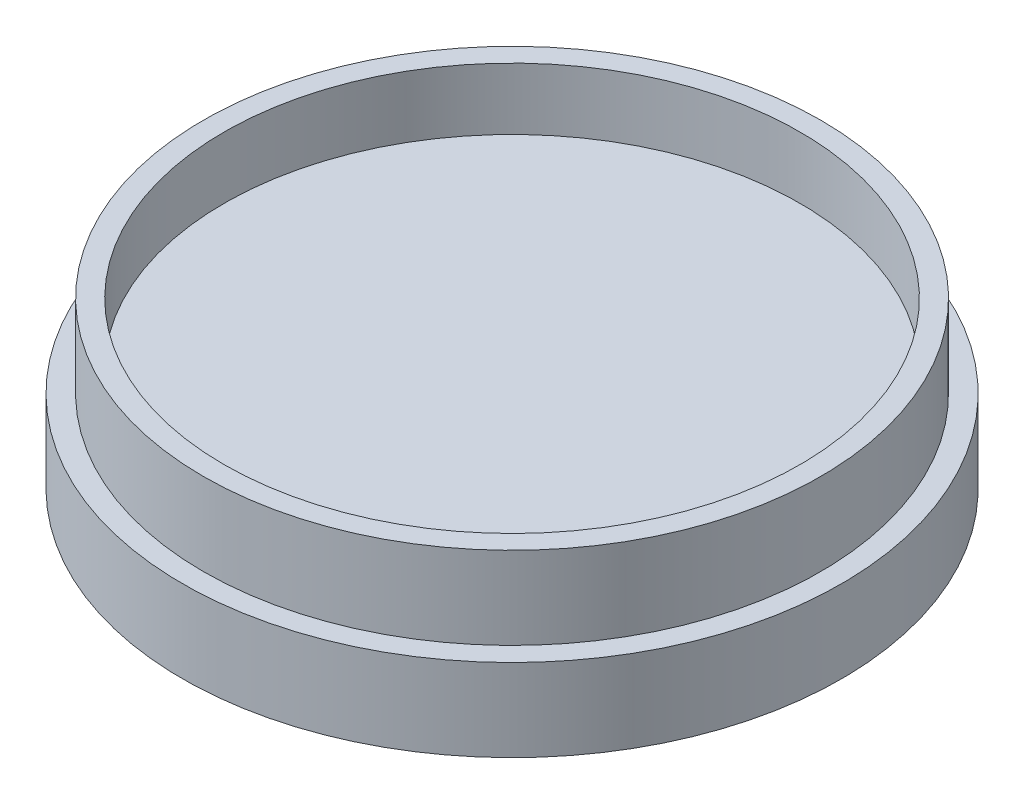
ISO-10303-21;
HEADER;
FILE_DESCRIPTION(('STEP AP214'),'2;1');
FILE_NAME('part.step','',(''),(''),'','','');
FILE_SCHEMA(('AUTOMOTIVE_DESIGN { 1 0 10303 214 1 1 1 1 }'));
ENDSEC;
DATA;
#1=APPLICATION_CONTEXT('core data for automotive mechanical design processes');
#2=APPLICATION_PROTOCOL_DEFINITION('international standard','automotive_design',2000,#1);
#3=PRODUCT_CONTEXT('',#1,'mechanical');
#4=PRODUCT('Part','Part','',(#3));
#5=PRODUCT_RELATED_PRODUCT_CATEGORY('part','',(#4));
#6=PRODUCT_DEFINITION_FORMATION('','',#4);
#7=PRODUCT_DEFINITION_CONTEXT('part definition',#1,'design');
#8=PRODUCT_DEFINITION('design','',#6,#7);
#9=PRODUCT_DEFINITION_SHAPE('','',#8);
#10=(LENGTH_UNIT() NAMED_UNIT(*) SI_UNIT(.MILLI.,.METRE.));
#11=(NAMED_UNIT(*) PLANE_ANGLE_UNIT() SI_UNIT($,.RADIAN.));
#12=(NAMED_UNIT(*) SI_UNIT($,.STERADIAN.) SOLID_ANGLE_UNIT());
#13=UNCERTAINTY_MEASURE_WITH_UNIT(LENGTH_MEASURE(1.E-05),#10,'distance_accuracy_value','');
#14=(GEOMETRIC_REPRESENTATION_CONTEXT(3) GLOBAL_UNCERTAINTY_ASSIGNED_CONTEXT((#13)) GLOBAL_UNIT_ASSIGNED_CONTEXT((#10,
#11,#12)) REPRESENTATION_CONTEXT('',''));
#15=CARTESIAN_POINT('',(0.,0.,0.));
#16=DIRECTION('',(0.,0.,1.));
#17=DIRECTION('',(1.,0.,0.));
#18=AXIS2_PLACEMENT_3D('',#15,#16,#17);
#19=CARTESIAN_POINT('',(0.,25.4,0.));
#20=DIRECTION('',(0.,-1.,0.));
#21=DIRECTION('',(0.,0.,-1.));
#22=AXIS2_PLACEMENT_3D('',#19,#20,#21);
#23=CYLINDRICAL_SURFACE('',#22,95.149999946);
#24=CARTESIAN_POINT('',(0.,25.4,0.));
#25=DIRECTION('',(0.,1.,0.));
#26=DIRECTION('',(0.,0.,1.));
#27=AXIS2_PLACEMENT_3D('',#24,#25,#26);
#28=CIRCLE('',#27,95.149999946);
#29=CARTESIAN_POINT('',(0.,25.4,95.149999946));
#30=VERTEX_POINT('',#29);
#31=EDGE_CURVE('E10',#30,#30,#28,.T.);
#32=ORIENTED_EDGE('',*,*,#31,.F.);
#33=EDGE_LOOP('',(#32));
#34=FACE_BOUND('',#33,.T.);
#35=CARTESIAN_POINT('',(0.,0.,0.));
#36=DIRECTION('',(0.,1.,0.));
#37=DIRECTION('',(0.,0.,1.));
#38=AXIS2_PLACEMENT_3D('',#35,#36,#37);
#39=CIRCLE('',#38,95.149999946);
#40=CARTESIAN_POINT('',(0.,0.,95.149999946));
#41=VERTEX_POINT('',#40);
#42=EDGE_CURVE('E34',#41,#41,#39,.T.);
#43=ORIENTED_EDGE('',*,*,#42,.T.);
#44=EDGE_LOOP('',(#43));
#45=FACE_BOUND('',#44,.T.);
#46=ADVANCED_FACE('F31',(#34,#45),#23,.T.);
#47=CARTESIAN_POINT('',(0.,25.4,0.));
#48=DIRECTION('',(0.,1.,0.));
#49=DIRECTION('',(0.,0.,1.));
#50=AXIS2_PLACEMENT_3D('',#47,#48,#49);
#51=PLANE('',#50);
#52=CARTESIAN_POINT('',(0.,25.4,0.));
#53=DIRECTION('',(0.,1.,0.));
#54=DIRECTION('',(0.,0.,1.));
#55=AXIS2_PLACEMENT_3D('',#52,#53,#54);
#56=CIRCLE('',#55,88.8);
#57=CARTESIAN_POINT('',(0.,25.4,88.8));
#58=VERTEX_POINT('',#57);
#59=EDGE_CURVE('E42',#58,#58,#56,.T.);
#60=ORIENTED_EDGE('',*,*,#59,.F.);
#61=EDGE_LOOP('',(#60));
#62=FACE_BOUND('',#61,.T.);
#63=ORIENTED_EDGE('',*,*,#31,.T.);
#64=EDGE_LOOP('',(#63));
#65=FACE_BOUND('',#64,.T.);
#66=ADVANCED_FACE('F127',(#62,#65),#51,.T.);
#67=CARTESIAN_POINT('',(0.,6.35,0.));
#68=DIRECTION('',(0.,1.,0.));
#69=DIRECTION('',(0.,0.,1.));
#70=AXIS2_PLACEMENT_3D('',#67,#68,#69);
#71=CYLINDRICAL_SURFACE('',#70,88.8);
#72=CARTESIAN_POINT('',(0.,6.35,0.));
#73=DIRECTION('',(0.,1.,0.));
#74=DIRECTION('',(0.,0.,1.));
#75=AXIS2_PLACEMENT_3D('',#72,#73,#74);
#76=CIRCLE('',#75,88.8);
#77=CARTESIAN_POINT('',(0.,6.35,88.8));
#78=VERTEX_POINT('',#77);
#79=EDGE_CURVE('E38',#78,#78,#76,.T.);
#80=ORIENTED_EDGE('',*,*,#79,.F.);
#81=EDGE_LOOP('',(#80));
#82=FACE_BOUND('',#81,.T.);
#83=ORIENTED_EDGE('',*,*,#59,.T.);
#84=EDGE_LOOP('',(#83));
#85=FACE_BOUND('',#84,.T.);
#86=ADVANCED_FACE('F132',(#82,#85),#71,.F.);
#87=CARTESIAN_POINT('',(0.,6.35,0.));
#88=DIRECTION('',(0.,1.,0.));
#89=DIRECTION('',(0.,0.,1.));
#90=AXIS2_PLACEMENT_3D('',#87,#88,#89);
#91=PLANE('',#90);
#92=ORIENTED_EDGE('',*,*,#79,.T.);
#93=EDGE_LOOP('',(#92));
#94=FACE_BOUND('',#93,.T.);
#95=ADVANCED_FACE('F111',(#94),#91,.T.);
#96=CARTESIAN_POINT('',(0.,-25.4,0.));
#97=DIRECTION('',(0.,1.,0.));
#98=DIRECTION('',(0.,0.,1.));
#99=AXIS2_PLACEMENT_3D('',#96,#97,#98);
#100=CYLINDRICAL_SURFACE('',#99,101.6);
#101=CARTESIAN_POINT('',(0.,-25.4,0.));
#102=DIRECTION('',(0.,-1.,0.));
#103=DIRECTION('',(0.,0.,-1.));
#104=AXIS2_PLACEMENT_3D('',#101,#102,#103);
#105=CIRCLE('',#104,101.6);
#106=CARTESIAN_POINT('',(0.,-25.4,-101.6));
#107=VERTEX_POINT('',#106);
#108=EDGE_CURVE('E50',#107,#107,#105,.T.);
#109=ORIENTED_EDGE('',*,*,#108,.F.);
#110=EDGE_LOOP('',(#109));
#111=FACE_BOUND('',#110,.T.);
#112=CARTESIAN_POINT('',(0.,0.,0.));
#113=DIRECTION('',(0.,-1.,0.));
#114=DIRECTION('',(0.,0.,-1.));
#115=AXIS2_PLACEMENT_3D('',#112,#113,#114);
#116=CIRCLE('',#115,101.6);
#117=CARTESIAN_POINT('',(0.,0.,-101.6));
#118=VERTEX_POINT('',#117);
#119=EDGE_CURVE('E47',#118,#118,#116,.T.);
#120=ORIENTED_EDGE('',*,*,#119,.T.);
#121=EDGE_LOOP('',(#120));
#122=FACE_BOUND('',#121,.T.);
#123=ADVANCED_FACE('F97',(#111,#122),#100,.T.);
#124=CARTESIAN_POINT('',(0.,-25.4,0.));
#125=DIRECTION('',(0.,-1.,0.));
#126=DIRECTION('',(0.,0.,-1.));
#127=AXIS2_PLACEMENT_3D('',#124,#125,#126);
#128=PLANE('',#127);
#129=CARTESIAN_POINT('',(0.,-25.4,82.55));
#130=DIRECTION('',(0.,-1.,0.));
#131=DIRECTION('',(0.,0.,-1.));
#132=AXIS2_PLACEMENT_3D('',#129,#130,#131);
#133=CIRCLE('',#132,12.827);
#134=CARTESIAN_POINT('',(0.,-25.4,69.723));
#135=VERTEX_POINT('',#134);
#136=EDGE_CURVE('E78',#135,#135,#133,.T.);
#137=ORIENTED_EDGE('',*,*,#136,.F.);
#138=EDGE_LOOP('',(#137));
#139=FACE_BOUND('',#138,.T.);
#140=CARTESIAN_POINT('',(78.5097154201666,-25.4,25.5093528856541));
#141=DIRECTION('',(0.,-1.,0.));
#142=DIRECTION('',(0.,0.,-1.));
#143=AXIS2_PLACEMENT_3D('',#140,#141,#142);
#144=CIRCLE('',#143,12.827);
#145=CARTESIAN_POINT('',(78.5097154201666,-25.4,12.6823528856541));
#146=VERTEX_POINT('',#145);
#147=EDGE_CURVE('E72',#146,#146,#144,.T.);
#148=ORIENTED_EDGE('',*,*,#147,.F.);
#149=EDGE_LOOP('',(#148));
#150=FACE_BOUND('',#149,.T.);
#151=CARTESIAN_POINT('',(48.5216725767479,-25.4,-66.7843528856505));
#152=DIRECTION('',(0.,-1.,0.));
#153=DIRECTION('',(0.,0.,-1.));
#154=AXIS2_PLACEMENT_3D('',#151,#152,#153);
#155=CIRCLE('',#154,12.827);
#156=CARTESIAN_POINT('',(48.5216725767479,-25.4,-79.6113528856505));
#157=VERTEX_POINT('',#156);
#158=EDGE_CURVE('E66',#157,#157,#155,.T.);
#159=ORIENTED_EDGE('',*,*,#158,.F.);
#160=EDGE_LOOP('',(#159));
#161=FACE_BOUND('',#160,.T.);
#162=CARTESIAN_POINT('',(-48.5216725767394,-25.4,-66.7843528856533));
#163=DIRECTION('',(0.,-1.,0.));
#164=DIRECTION('',(0.,0.,-1.));
#165=AXIS2_PLACEMENT_3D('',#162,#163,#164);
#166=CIRCLE('',#165,12.827);
#167=CARTESIAN_POINT('',(-48.5216725767394,-25.4,-79.6113528856533));
#168=VERTEX_POINT('',#167);
#169=EDGE_CURVE('E60',#168,#168,#166,.T.);
#170=ORIENTED_EDGE('',*,*,#169,.F.);
#171=EDGE_LOOP('',(#170));
#172=FACE_BOUND('',#171,.T.);
#173=CARTESIAN_POINT('',(-78.5097154201633,-25.4,25.5093528856497));
#174=DIRECTION('',(0.,-1.,0.));
#175=DIRECTION('',(0.,0.,-1.));
#176=AXIS2_PLACEMENT_3D('',#173,#174,#175);
#177=CIRCLE('',#176,12.827);
#178=CARTESIAN_POINT('',(-78.5097154201633,-25.4,12.6823528856497));
#179=VERTEX_POINT('',#178);
#180=EDGE_CURVE('E54',#179,#179,#177,.T.);
#181=ORIENTED_EDGE('',*,*,#180,.F.);
#182=EDGE_LOOP('',(#181));
#183=FACE_BOUND('',#182,.T.);
#184=ORIENTED_EDGE('',*,*,#108,.T.);
#185=EDGE_LOOP('',(#184));
#186=FACE_BOUND('',#185,.T.);
#187=ADVANCED_FACE('F93',(#139,#150,#161,#172,#183,#186),#128,.T.);
#188=CARTESIAN_POINT('',(0.,0.,0.));
#189=DIRECTION('',(0.,-1.,0.));
#190=DIRECTION('',(0.,0.,-1.));
#191=AXIS2_PLACEMENT_3D('',#188,#189,#190);
#192=PLANE('',#191);
#193=ORIENTED_EDGE('',*,*,#42,.F.);
#194=EDGE_LOOP('',(#193));
#195=FACE_BOUND('',#194,.T.);
#196=ORIENTED_EDGE('',*,*,#119,.F.);
#197=EDGE_LOOP('',(#196));
#198=FACE_BOUND('',#197,.T.);
#199=ADVANCED_FACE('F96',(#195,#198),#192,.F.);
#200=CARTESIAN_POINT('',(-78.5097154201633,-6.35,25.5093528856497));
#201=DIRECTION('',(0.,-1.,0.));
#202=DIRECTION('',(0.,0.,-1.));
#203=AXIS2_PLACEMENT_3D('',#200,#201,#202);
#204=CYLINDRICAL_SURFACE('',#203,12.827);
#205=CARTESIAN_POINT('',(-78.5097154201633,-6.35,25.5093528856497));
#206=DIRECTION('',(0.,-1.,0.));
#207=DIRECTION('',(0.,0.,-1.));
#208=AXIS2_PLACEMENT_3D('',#205,#206,#207);
#209=CIRCLE('',#208,12.827);
#210=CARTESIAN_POINT('',(-78.5097154201633,-6.35,12.6823528856497));
#211=VERTEX_POINT('',#210);
#212=EDGE_CURVE('E57',#211,#211,#209,.T.);
#213=ORIENTED_EDGE('',*,*,#212,.F.);
#214=EDGE_LOOP('',(#213));
#215=FACE_BOUND('',#214,.T.);
#216=ORIENTED_EDGE('',*,*,#180,.T.);
#217=EDGE_LOOP('',(#216));
#218=FACE_BOUND('',#217,.T.);
#219=ADVANCED_FACE('F116',(#215,#218),#204,.F.);
#220=CARTESIAN_POINT('',(-78.5097154201633,-6.35,25.5093528856497));
#221=DIRECTION('',(0.,-1.,0.));
#222=DIRECTION('',(0.,0.,-1.));
#223=AXIS2_PLACEMENT_3D('',#220,#221,#222);
#224=PLANE('',#223);
#225=ORIENTED_EDGE('',*,*,#212,.T.);
#226=EDGE_LOOP('',(#225));
#227=FACE_BOUND('',#226,.T.);
#228=ADVANCED_FACE('F122',(#227),#224,.T.);
#229=CARTESIAN_POINT('',(-48.5216725767394,-6.35,-66.7843528856533));
#230=DIRECTION('',(0.,-1.,0.));
#231=DIRECTION('',(0.,0.,-1.));
#232=AXIS2_PLACEMENT_3D('',#229,#230,#231);
#233=CYLINDRICAL_SURFACE('',#232,12.827);
#234=CARTESIAN_POINT('',(-48.5216725767394,-6.35,-66.7843528856533));
#235=DIRECTION('',(0.,-1.,0.));
#236=DIRECTION('',(0.,0.,-1.));
#237=AXIS2_PLACEMENT_3D('',#234,#235,#236);
#238=CIRCLE('',#237,12.827);
#239=CARTESIAN_POINT('',(-48.5216725767394,-6.35,-79.6113528856533));
#240=VERTEX_POINT('',#239);
#241=EDGE_CURVE('E63',#240,#240,#238,.T.);
#242=ORIENTED_EDGE('',*,*,#241,.F.);
#243=EDGE_LOOP('',(#242));
#244=FACE_BOUND('',#243,.T.);
#245=ORIENTED_EDGE('',*,*,#169,.T.);
#246=EDGE_LOOP('',(#245));
#247=FACE_BOUND('',#246,.T.);
#248=ADVANCED_FACE('F176',(#244,#247),#233,.F.);
#249=CARTESIAN_POINT('',(-48.5216725767394,-6.35,-66.7843528856533));
#250=DIRECTION('',(0.,-1.,0.));
#251=DIRECTION('',(0.,0.,-1.));
#252=AXIS2_PLACEMENT_3D('',#249,#250,#251);
#253=PLANE('',#252);
#254=ORIENTED_EDGE('',*,*,#241,.T.);
#255=EDGE_LOOP('',(#254));
#256=FACE_BOUND('',#255,.T.);
#257=ADVANCED_FACE('F186',(#256),#253,.T.);
#258=CARTESIAN_POINT('',(48.5216725767479,-6.35,-66.7843528856505));
#259=DIRECTION('',(0.,-1.,0.));
#260=DIRECTION('',(0.,0.,-1.));
#261=AXIS2_PLACEMENT_3D('',#258,#259,#260);
#262=CYLINDRICAL_SURFACE('',#261,12.827);
#263=CARTESIAN_POINT('',(48.5216725767479,-6.35,-66.7843528856505));
#264=DIRECTION('',(0.,-1.,0.));
#265=DIRECTION('',(0.,0.,-1.));
#266=AXIS2_PLACEMENT_3D('',#263,#264,#265);
#267=CIRCLE('',#266,12.827);
#268=CARTESIAN_POINT('',(48.5216725767479,-6.35,-79.6113528856505));
#269=VERTEX_POINT('',#268);
#270=EDGE_CURVE('E69',#269,#269,#267,.T.);
#271=ORIENTED_EDGE('',*,*,#270,.F.);
#272=EDGE_LOOP('',(#271));
#273=FACE_BOUND('',#272,.T.);
#274=ORIENTED_EDGE('',*,*,#158,.T.);
#275=EDGE_LOOP('',(#274));
#276=FACE_BOUND('',#275,.T.);
#277=ADVANCED_FACE('F196',(#273,#276),#262,.F.);
#278=CARTESIAN_POINT('',(48.5216725767479,-6.35,-66.7843528856505));
#279=DIRECTION('',(0.,-1.,0.));
#280=DIRECTION('',(0.,0.,-1.));
#281=AXIS2_PLACEMENT_3D('',#278,#279,#280);
#282=PLANE('',#281);
#283=ORIENTED_EDGE('',*,*,#270,.T.);
#284=EDGE_LOOP('',(#283));
#285=FACE_BOUND('',#284,.T.);
#286=ADVANCED_FACE('F206',(#285),#282,.T.);
#287=CARTESIAN_POINT('',(78.5097154201666,-6.35,25.5093528856541));
#288=DIRECTION('',(0.,-1.,0.));
#289=DIRECTION('',(0.,0.,-1.));
#290=AXIS2_PLACEMENT_3D('',#287,#288,#289);
#291=CYLINDRICAL_SURFACE('',#290,12.827);
#292=CARTESIAN_POINT('',(78.5097154201666,-6.35,25.5093528856541));
#293=DIRECTION('',(0.,-1.,0.));
#294=DIRECTION('',(0.,0.,-1.));
#295=AXIS2_PLACEMENT_3D('',#292,#293,#294);
#296=CIRCLE('',#295,12.827);
#297=CARTESIAN_POINT('',(78.5097154201666,-6.35,12.6823528856541));
#298=VERTEX_POINT('',#297);
#299=EDGE_CURVE('E75',#298,#298,#296,.T.);
#300=ORIENTED_EDGE('',*,*,#299,.F.);
#301=EDGE_LOOP('',(#300));
#302=FACE_BOUND('',#301,.T.);
#303=ORIENTED_EDGE('',*,*,#147,.T.);
#304=EDGE_LOOP('',(#303));
#305=FACE_BOUND('',#304,.T.);
#306=ADVANCED_FACE('F216',(#302,#305),#291,.F.);
#307=CARTESIAN_POINT('',(78.5097154201666,-6.35,25.5093528856541));
#308=DIRECTION('',(0.,-1.,0.));
#309=DIRECTION('',(0.,0.,-1.));
#310=AXIS2_PLACEMENT_3D('',#307,#308,#309);
#311=PLANE('',#310);
#312=ORIENTED_EDGE('',*,*,#299,.T.);
#313=EDGE_LOOP('',(#312));
#314=FACE_BOUND('',#313,.T.);
#315=ADVANCED_FACE('F89',(#314),#311,.T.);
#316=CARTESIAN_POINT('',(0.,-6.35,82.55));
#317=DIRECTION('',(0.,-1.,0.));
#318=DIRECTION('',(0.,0.,-1.));
#319=AXIS2_PLACEMENT_3D('',#316,#317,#318);
#320=CYLINDRICAL_SURFACE('',#319,12.827);
#321=CARTESIAN_POINT('',(0.,-6.35,82.55));
#322=DIRECTION('',(0.,-1.,0.));
#323=DIRECTION('',(0.,0.,-1.));
#324=AXIS2_PLACEMENT_3D('',#321,#322,#323);
#325=CIRCLE('',#324,12.827);
#326=CARTESIAN_POINT('',(0.,-6.35,69.723));
#327=VERTEX_POINT('',#326);
#328=EDGE_CURVE('E51',#327,#327,#325,.T.);
#329=ORIENTED_EDGE('',*,*,#328,.F.);
#330=EDGE_LOOP('',(#329));
#331=FACE_BOUND('',#330,.T.);
#332=ORIENTED_EDGE('',*,*,#136,.T.);
#333=EDGE_LOOP('',(#332));
#334=FACE_BOUND('',#333,.T.);
#335=ADVANCED_FACE('F86',(#331,#334),#320,.F.);
#336=CARTESIAN_POINT('',(0.,-6.35,82.55));
#337=DIRECTION('',(0.,-1.,0.));
#338=DIRECTION('',(0.,0.,-1.));
#339=AXIS2_PLACEMENT_3D('',#336,#337,#338);
#340=PLANE('',#339);
#341=ORIENTED_EDGE('',*,*,#328,.T.);
#342=EDGE_LOOP('',(#341));
#343=FACE_BOUND('',#342,.T.);
#344=ADVANCED_FACE('F84',(#343),#340,.T.);
#345=CLOSED_SHELL('',(#46,#66,#86,#95,#123,#187,#199,#219,#228,#248,#257,#277,#286,#306,#315,
#335,#344));
#346=MANIFOLD_SOLID_BREP('B2',#345);
#347=ADVANCED_BREP_SHAPE_REPRESENTATION('',(#18,#346),#14);
#348=SHAPE_DEFINITION_REPRESENTATION(#9,#347);
ENDSEC;
END-ISO-10303-21;
